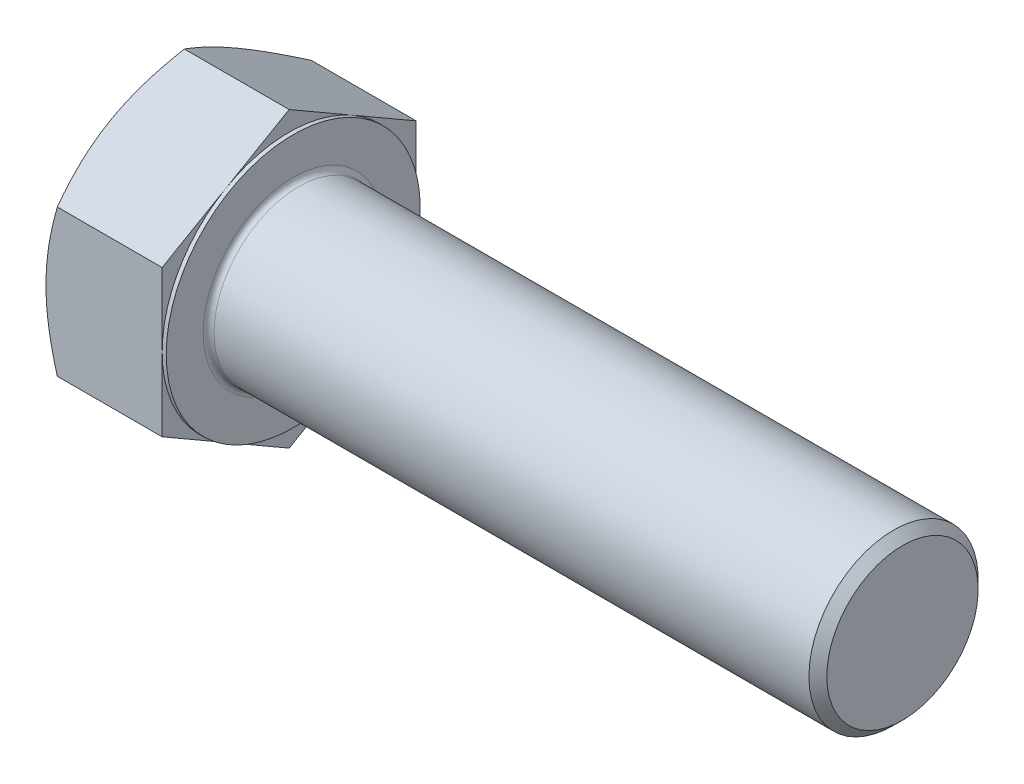
ISO-10303-21;
HEADER;
FILE_DESCRIPTION(('STEP AP214'),'2;1');
FILE_NAME('part.step','',(''),(''),'','','');
FILE_SCHEMA(('AUTOMOTIVE_DESIGN { 1 0 10303 214 1 1 1 1 }'));
ENDSEC;
DATA;
#1=APPLICATION_CONTEXT('core data for automotive mechanical design processes');
#2=APPLICATION_PROTOCOL_DEFINITION('international standard','automotive_design',2000,#1);
#3=PRODUCT_CONTEXT('',#1,'mechanical');
#4=PRODUCT('Part','Part','',(#3));
#5=PRODUCT_RELATED_PRODUCT_CATEGORY('part','',(#4));
#6=PRODUCT_DEFINITION_FORMATION('','',#4);
#7=PRODUCT_DEFINITION_CONTEXT('part definition',#1,'design');
#8=PRODUCT_DEFINITION('design','',#6,#7);
#9=PRODUCT_DEFINITION_SHAPE('','',#8);
#10=(LENGTH_UNIT() NAMED_UNIT(*) SI_UNIT(.MILLI.,.METRE.));
#11=(NAMED_UNIT(*) PLANE_ANGLE_UNIT() SI_UNIT($,.RADIAN.));
#12=(NAMED_UNIT(*) SI_UNIT($,.STERADIAN.) SOLID_ANGLE_UNIT());
#13=UNCERTAINTY_MEASURE_WITH_UNIT(LENGTH_MEASURE(1.E-05),#10,'distance_accuracy_value','');
#14=(GEOMETRIC_REPRESENTATION_CONTEXT(3) GLOBAL_UNCERTAINTY_ASSIGNED_CONTEXT((#13)) GLOBAL_UNIT_ASSIGNED_CONTEXT((#10,
#11,#12)) REPRESENTATION_CONTEXT('',''));
#15=CARTESIAN_POINT('',(0.,0.,0.));
#16=DIRECTION('',(0.,0.,1.));
#17=DIRECTION('',(1.,0.,0.));
#18=AXIS2_PLACEMENT_3D('',#15,#16,#17);
#19=CARTESIAN_POINT('',(11.2776,13.7554856334967,0.));
#20=DIRECTION('',(1.,0.,0.));
#21=DIRECTION('',(0.,0.,-1.));
#22=AXIS2_PLACEMENT_3D('',#19,#20,#21);
#23=PLANE('',#22);
#24=CARTESIAN_POINT('',(11.2776,0.,0.));
#25=DIRECTION('',(1.,0.,0.));
#26=DIRECTION('',(0.,0.,-1.));
#27=AXIS2_PLACEMENT_3D('',#24,#25,#26);
#28=CIRCLE('',#27,8.4455);
#29=CARTESIAN_POINT('',(11.2776,0.,-8.4455));
#30=VERTEX_POINT('',#29);
#31=EDGE_CURVE('E43',#30,#30,#28,.F.);
#32=ORIENTED_EDGE('',*,*,#31,.T.);
#33=EDGE_LOOP('',(#32));
#34=FACE_BOUND('',#33,.T.);
#35=CARTESIAN_POINT('',(11.2776,0.,0.));
#36=DIRECTION('',(1.,0.,0.));
#37=DIRECTION('',(0.,0.,-1.));
#38=AXIS2_PLACEMENT_3D('',#35,#36,#37);
#39=CIRCLE('',#38,11.9126);
#40=CARTESIAN_POINT('',(11.2776,0.,-11.9126));
#41=VERTEX_POINT('',#40);
#42=EDGE_CURVE('E256',#41,#41,#39,.T.);
#43=ORIENTED_EDGE('',*,*,#42,.T.);
#44=EDGE_LOOP('',(#43));
#45=FACE_BOUND('',#44,.T.);
#46=ADVANCED_FACE('F34',(#34,#45),#23,.T.);
#47=CARTESIAN_POINT('',(0.,0.,0.));
#48=DIRECTION('',(-1.,0.,0.));
#49=DIRECTION('',(0.,0.,1.));
#50=AXIS2_PLACEMENT_3D('',#47,#48,#49);
#51=CYLINDRICAL_SURFACE('',#50,7.9375);
#52=CARTESIAN_POINT('',(11.7856,0.,0.));
#53=DIRECTION('',(1.,0.,0.));
#54=DIRECTION('',(0.,0.,-1.));
#55=AXIS2_PLACEMENT_3D('',#52,#53,#54);
#56=CIRCLE('',#55,7.9375);
#57=CARTESIAN_POINT('',(11.7856,0.,-7.9375));
#58=VERTEX_POINT('',#57);
#59=EDGE_CURVE('E11',#58,#58,#56,.T.);
#60=ORIENTED_EDGE('',*,*,#59,.T.);
#61=EDGE_LOOP('',(#60));
#62=FACE_BOUND('',#61,.T.);
#63=CARTESIAN_POINT('',(67.58813,0.,0.));
#64=DIRECTION('',(-1.,0.,0.));
#65=DIRECTION('',(0.,0.,1.));
#66=AXIS2_PLACEMENT_3D('',#63,#64,#65);
#67=CIRCLE('',#66,7.9375);
#68=CARTESIAN_POINT('',(67.58813,0.,7.9375));
#69=VERTEX_POINT('',#68);
#70=EDGE_CURVE('E300',#69,#69,#67,.T.);
#71=ORIENTED_EDGE('',*,*,#70,.T.);
#72=EDGE_LOOP('',(#71));
#73=FACE_BOUND('',#72,.T.);
#74=ADVANCED_FACE('F243',(#62,#73),#51,.T.);
#75=CARTESIAN_POINT('',(68.4276,0.,0.));
#76=DIRECTION('',(-1.,0.,0.));
#77=DIRECTION('',(0.,0.,1.));
#78=AXIS2_PLACEMENT_3D('',#75,#76,#77);
#79=CONICAL_SURFACE('',#78,7.09803,0.785398163397435);
#80=ORIENTED_EDGE('',*,*,#70,.F.);
#81=EDGE_LOOP('',(#80));
#82=FACE_BOUND('',#81,.T.);
#83=CARTESIAN_POINT('',(68.4276,0.,0.));
#84=DIRECTION('',(-1.,0.,0.));
#85=DIRECTION('',(0.,0.,1.));
#86=AXIS2_PLACEMENT_3D('',#83,#84,#85);
#87=CIRCLE('',#86,7.09803);
#88=CARTESIAN_POINT('',(68.4276,0.,7.09803));
#89=VERTEX_POINT('',#88);
#90=EDGE_CURVE('E302',#89,#89,#87,.T.);
#91=ORIENTED_EDGE('',*,*,#90,.T.);
#92=EDGE_LOOP('',(#91));
#93=FACE_BOUND('',#92,.T.);
#94=ADVANCED_FACE('F248',(#82,#93),#79,.T.);
#95=CARTESIAN_POINT('',(68.4276,0.,0.));
#96=DIRECTION('',(-1.,0.,0.));
#97=DIRECTION('',(0.,0.,1.));
#98=AXIS2_PLACEMENT_3D('',#95,#96,#97);
#99=PLANE('',#98);
#100=ORIENTED_EDGE('',*,*,#90,.F.);
#101=EDGE_LOOP('',(#100));
#102=FACE_BOUND('',#101,.T.);
#103=ADVANCED_FACE('F349',(#102),#99,.F.);
#104=CARTESIAN_POINT('',(10.8966,11.9126,0.));
#105=DIRECTION('',(1.,0.,0.));
#106=DIRECTION('',(0.,0.,-1.));
#107=AXIS2_PLACEMENT_3D('',#104,#105,#106);
#108=PLANE('',#107);
#109=DIRECTION('',(0.,0.500000000000001,0.866025403784438));
#110=VECTOR('',#109,1.);
#111=CARTESIAN_POINT('',(10.8966,6.87774281674832,-11.9126));
#112=LINE('',#111,#110);
#113=CARTESIAN_POINT('',(10.8966,6.87774281674832,-11.9126));
#114=VERTEX_POINT('',#113);
#115=CARTESIAN_POINT('',(10.8966,10.3166142251225,-5.95630000000001));
#116=VERTEX_POINT('',#115);
#117=EDGE_CURVE('E167',#114,#116,#112,.T.);
#118=ORIENTED_EDGE('',*,*,#117,.T.);
#119=CARTESIAN_POINT('',(10.8966,0.,0.));
#120=DIRECTION('',(-1.,0.,0.));
#121=DIRECTION('',(0.,0.,1.));
#122=AXIS2_PLACEMENT_3D('',#119,#120,#121);
#123=CIRCLE('',#122,11.9126);
#124=CARTESIAN_POINT('',(10.8966,0.,-11.9126));
#125=VERTEX_POINT('',#124);
#126=EDGE_CURVE('E50',#116,#125,#123,.T.);
#127=ORIENTED_EDGE('',*,*,#126,.T.);
#128=DIRECTION('',(0.,1.,0.));
#129=VECTOR('',#128,1.);
#130=CARTESIAN_POINT('',(10.8966,6.87774281674832,-11.9126));
#131=LINE('',#130,#129);
#132=EDGE_CURVE('E257',#125,#114,#131,.T.);
#133=ORIENTED_EDGE('',*,*,#132,.T.);
#134=EDGE_LOOP('',(#118,#127,#133));
#135=FACE_BOUND('',#134,.T.);
#136=ADVANCED_FACE('F279',(#135),#108,.T.);
#137=CARTESIAN_POINT('',(10.8966,13.7554856334967,0.));
#138=VERTEX_POINT('',#137);
#139=EDGE_CURVE('E165',#116,#138,#112,.T.);
#140=ORIENTED_EDGE('',*,*,#139,.T.);
#141=DIRECTION('',(0.,-0.500000000000001,0.866025403784438));
#142=VECTOR('',#141,1.);
#143=CARTESIAN_POINT('',(10.8966,13.7554856334967,0.));
#144=LINE('',#143,#142);
#145=CARTESIAN_POINT('',(10.8966,10.3166142251225,5.95630000000001));
#146=VERTEX_POINT('',#145);
#147=EDGE_CURVE('E164',#138,#146,#144,.T.);
#148=ORIENTED_EDGE('',*,*,#147,.T.);
#149=EDGE_CURVE('E153',#146,#116,#123,.T.);
#150=ORIENTED_EDGE('',*,*,#149,.T.);
#151=EDGE_LOOP('',(#140,#148,#150));
#152=FACE_BOUND('',#151,.T.);
#153=ADVANCED_FACE('F286',(#152),#108,.T.);
#154=CARTESIAN_POINT('',(10.8966,6.87774281674832,11.9126));
#155=VERTEX_POINT('',#154);
#156=EDGE_CURVE('E132',#146,#155,#144,.T.);
#157=ORIENTED_EDGE('',*,*,#156,.T.);
#158=DIRECTION('',(0.,-1.,0.));
#159=VECTOR('',#158,1.);
#160=CARTESIAN_POINT('',(10.8966,6.87774281674832,11.9126));
#161=LINE('',#160,#159);
#162=CARTESIAN_POINT('',(10.8966,0.,11.9126));
#163=VERTEX_POINT('',#162);
#164=EDGE_CURVE('E126',#155,#163,#161,.T.);
#165=ORIENTED_EDGE('',*,*,#164,.T.);
#166=EDGE_CURVE('E130',#163,#146,#123,.T.);
#167=ORIENTED_EDGE('',*,*,#166,.T.);
#168=EDGE_LOOP('',(#157,#165,#167));
#169=FACE_BOUND('',#168,.T.);
#170=ADVANCED_FACE('F128',(#169),#108,.T.);
#171=CARTESIAN_POINT('',(10.8966,-6.87774281674834,11.9126));
#172=VERTEX_POINT('',#171);
#173=EDGE_CURVE('E136',#163,#172,#161,.T.);
#174=ORIENTED_EDGE('',*,*,#173,.T.);
#175=DIRECTION('',(0.,-0.500000000000001,-0.866025403784438));
#176=VECTOR('',#175,1.);
#177=CARTESIAN_POINT('',(10.8966,-13.7554856334967,0.));
#178=LINE('',#177,#176);
#179=CARTESIAN_POINT('',(10.8966,-10.3166142251225,5.95630000000001));
#180=VERTEX_POINT('',#179);
#181=EDGE_CURVE('E143',#172,#180,#178,.T.);
#182=ORIENTED_EDGE('',*,*,#181,.T.);
#183=EDGE_CURVE('E140',#180,#163,#123,.T.);
#184=ORIENTED_EDGE('',*,*,#183,.T.);
#185=EDGE_LOOP('',(#174,#182,#184));
#186=FACE_BOUND('',#185,.T.);
#187=ADVANCED_FACE('F141',(#186),#108,.T.);
#188=CARTESIAN_POINT('',(10.8966,-13.7554856334967,0.));
#189=VERTEX_POINT('',#188);
#190=EDGE_CURVE('E159',#180,#189,#178,.T.);
#191=ORIENTED_EDGE('',*,*,#190,.T.);
#192=DIRECTION('',(0.,0.5,-0.866025403784439));
#193=VECTOR('',#192,1.);
#194=CARTESIAN_POINT('',(10.8966,-6.87774281674835,-11.9126));
#195=LINE('',#194,#193);
#196=CARTESIAN_POINT('',(10.8966,-10.3166142251225,-5.9563));
#197=VERTEX_POINT('',#196);
#198=EDGE_CURVE('E340',#189,#197,#195,.T.);
#199=ORIENTED_EDGE('',*,*,#198,.T.);
#200=EDGE_CURVE('E147',#197,#180,#123,.T.);
#201=ORIENTED_EDGE('',*,*,#200,.T.);
#202=EDGE_LOOP('',(#191,#199,#201));
#203=FACE_BOUND('',#202,.T.);
#204=ADVANCED_FACE('F341',(#203),#108,.T.);
#205=CARTESIAN_POINT('',(10.8966,-6.87774281674835,-11.9126));
#206=VERTEX_POINT('',#205);
#207=EDGE_CURVE('E154',#197,#206,#195,.T.);
#208=ORIENTED_EDGE('',*,*,#207,.T.);
#209=EDGE_CURVE('E260',#206,#125,#131,.T.);
#210=ORIENTED_EDGE('',*,*,#209,.T.);
#211=EDGE_CURVE('E272',#125,#197,#123,.T.);
#212=ORIENTED_EDGE('',*,*,#211,.T.);
#213=EDGE_LOOP('',(#208,#210,#212));
#214=FACE_BOUND('',#213,.T.);
#215=ADVANCED_FACE('F271',(#214),#108,.T.);
#216=CARTESIAN_POINT('',(0.,0.,0.));
#217=DIRECTION('',(-1.,0.,0.));
#218=DIRECTION('',(0.,0.,1.));
#219=AXIS2_PLACEMENT_3D('',#216,#217,#218);
#220=CYLINDRICAL_SURFACE('',#219,11.9126);
#221=ORIENTED_EDGE('',*,*,#126,.F.);
#222=ORIENTED_EDGE('',*,*,#149,.F.);
#223=ORIENTED_EDGE('',*,*,#166,.F.);
#224=ORIENTED_EDGE('',*,*,#183,.F.);
#225=ORIENTED_EDGE('',*,*,#200,.F.);
#226=ORIENTED_EDGE('',*,*,#211,.F.);
#227=EDGE_LOOP('',(#221,#222,#223,#224,#225,#226));
#228=FACE_BOUND('',#227,.T.);
#229=ORIENTED_EDGE('',*,*,#42,.F.);
#230=EDGE_LOOP('',(#229));
#231=FACE_BOUND('',#230,.T.);
#232=ADVANCED_FACE('F150',(#228,#231),#220,.T.);
#233=CARTESIAN_POINT('',(0.,13.7554856334967,0.));
#234=DIRECTION('',(1.,0.,0.));
#235=DIRECTION('',(0.,0.,-1.));
#236=AXIS2_PLACEMENT_3D('',#233,#234,#235);
#237=PLANE('',#236);
#238=CARTESIAN_POINT('',(0.,0.,0.));
#239=DIRECTION('',(1.,0.,0.));
#240=DIRECTION('',(0.,0.,-1.));
#241=AXIS2_PLACEMENT_3D('',#238,#239,#240);
#242=CIRCLE('',#241,11.9126);
#243=CARTESIAN_POINT('',(0.,0.,-11.9126));
#244=VERTEX_POINT('',#243);
#245=CARTESIAN_POINT('',(0.,10.3166142251225,-5.95630000000001));
#246=VERTEX_POINT('',#245);
#247=EDGE_CURVE('E258',#244,#246,#242,.T.);
#248=ORIENTED_EDGE('',*,*,#247,.F.);
#249=CARTESIAN_POINT('',(0.,-10.3166142251225,-5.9563));
#250=VERTEX_POINT('',#249);
#251=EDGE_CURVE('E264',#250,#244,#242,.T.);
#252=ORIENTED_EDGE('',*,*,#251,.F.);
#253=CARTESIAN_POINT('',(0.,-10.3166142251225,5.95630000000001));
#254=VERTEX_POINT('',#253);
#255=EDGE_CURVE('E322',#254,#250,#242,.T.);
#256=ORIENTED_EDGE('',*,*,#255,.F.);
#257=CARTESIAN_POINT('',(0.,0.,11.9126));
#258=VERTEX_POINT('',#257);
#259=EDGE_CURVE('E318',#258,#254,#242,.T.);
#260=ORIENTED_EDGE('',*,*,#259,.F.);
#261=CARTESIAN_POINT('',(0.,0.,0.));
#262=DIRECTION('',(-1.,0.,0.));
#263=DIRECTION('',(0.,0.,1.));
#264=AXIS2_PLACEMENT_3D('',#261,#262,#263);
#265=CIRCLE('',#264,11.9126);
#266=CARTESIAN_POINT('',(0.,10.3166142251225,5.95630000000001));
#267=VERTEX_POINT('',#266);
#268=EDGE_CURVE('E168',#258,#267,#265,.T.);
#269=ORIENTED_EDGE('',*,*,#268,.T.);
#270=EDGE_CURVE('E262',#246,#267,#242,.T.);
#271=ORIENTED_EDGE('',*,*,#270,.F.);
#272=EDGE_LOOP('',(#248,#252,#256,#260,#269,#271));
#273=FACE_BOUND('',#272,.T.);
#274=ADVANCED_FACE('F319',(#273),#237,.F.);
#275=CARTESIAN_POINT('',(0.,0.,0.));
#276=DIRECTION('',(1.,0.,0.));
#277=DIRECTION('',(0.,0.,-1.));
#278=AXIS2_PLACEMENT_3D('',#275,#276,#277);
#279=CONICAL_SURFACE('',#278,11.9126,1.0471975511966);
#280=CARTESIAN_POINT('',(1.06405718409108,6.87762734669449,11.9128));
#281=CARTESIAN_POINT('',(0.976783664508617,7.02881492530846,11.6509354323673));
#282=CARTESIAN_POINT('',(0.893471253108558,7.18056620885786,11.3880944991459));
#283=CARTESIAN_POINT('',(0.735867732768955,7.48528570607427,10.8603048479103));
#284=CARTESIAN_POINT('',(0.661579590915739,7.63825430246197,10.5953554670043));
#285=CARTESIAN_POINT('',(0.453689244257348,8.09962486135311,9.79623821788836));
#286=CARTESIAN_POINT('',(0.335442444727208,8.40984814214741,9.25891573386193));
#287=CARTESIAN_POINT('',(0.196787480113801,8.87408305648911,8.45483727557474));
#288=CARTESIAN_POINT('',(0.157289977847039,9.02670778330657,8.19048349423558));
#289=CARTESIAN_POINT('',(0.0910554529301021,9.33266389998358,7.66055195526452));
#290=CARTESIAN_POINT('',(0.0643186758890399,9.48599530338738,7.3949741741733));
#291=CARTESIAN_POINT('',(0.0242904493695607,9.79291374255692,6.86337584375192));
#292=CARTESIAN_POINT('',(0.0109830224718128,9.94650025627591,6.59735619863326));
#293=CARTESIAN_POINT('',(-0.00190293681881722,10.2538155954142,6.06507041730042));
#294=CARTESIAN_POINT('',(-0.00148189340275153,10.4075444162897,5.79880428895645));
#295=CARTESIAN_POINT('',(0.0121309718551364,10.6949407144099,5.30101929870509));
#296=CARTESIAN_POINT('',(0.0236623230980982,10.8286286877692,5.06946493648576));
#297=CARTESIAN_POINT('',(0.0568905531657718,11.0956971533324,4.60688878503089));
#298=CARTESIAN_POINT('',(0.0785881510523466,11.2290776231157,4.37586703462887));
#299=CARTESIAN_POINT('',(0.131770595047064,11.4954585954488,3.91448165637838));
#300=CARTESIAN_POINT('',(0.163263524933217,11.6284586922618,3.68411873128659));
#301=CARTESIAN_POINT('',(0.235484072021093,11.8938353504966,3.22447287608111));
#302=CARTESIAN_POINT('',(0.276212316904162,12.0262118689121,2.9951900204564));
#303=CARTESIAN_POINT('',(0.413279595473438,12.4280482226135,2.29918903951742));
#304=CARTESIAN_POINT('',(0.523285805769445,12.6963443903513,1.83448644551948));
#305=CARTESIAN_POINT('',(0.772955074257754,13.2289360452756,0.912010639503379));
#306=CARTESIAN_POINT('',(0.912559494718526,13.4932383517035,0.45422561621254));
#307=CARTESIAN_POINT('',(1.06405718409109,13.7556011035505,-0.000199999999998149));
#308=B_SPLINE_CURVE_WITH_KNOTS('',3,(#280,#281,#282,#283,#284,#285,#286,#287,#288,#289,#290,
#291,#292,#293,#294,#295,#296,#297,#298,#299,#300,#301,#302,#303,#304,#305,#306,#307),
.UNSPECIFIED.,.F.,.F.,(4,2,2,2,2,2,2,2,2,2,2,2,2,4),(0.,0.944078444311424,1.88846645648341,
3.78126264443506,4.70443047983598,5.62761608298022,6.54970203686552,7.47175949957655,
8.27443960121627,9.0771764852477,9.8805776083397,10.6840333512391,12.3262779583689,
13.9652989788094),.UNSPECIFIED.);
#309=CARTESIAN_POINT('',(1.06399051658499,13.7554856334967,0.));
#310=VERTEX_POINT('',#309);
#311=EDGE_CURVE('E214',#267,#310,#308,.T.);
#312=ORIENTED_EDGE('',*,*,#311,.T.);
#313=CARTESIAN_POINT('',(1.06405718409109,13.7556011035505,0.0002));
#314=CARTESIAN_POINT('',(0.976783664508627,13.6044135249365,-0.261664567632711));
#315=CARTESIAN_POINT('',(0.893471253108567,13.4526622413871,-0.52450550085407));
#316=CARTESIAN_POINT('',(0.735867732768963,13.1479427441707,-1.05229515208973));
#317=CARTESIAN_POINT('',(0.661579590915747,12.994974147783,-1.31724453299573));
#318=CARTESIAN_POINT('',(0.453689244257354,12.5336035888919,-2.11636178211163));
#319=CARTESIAN_POINT('',(0.335442444727213,12.2233803080976,-2.65368426613807));
#320=CARTESIAN_POINT('',(0.196787480113805,11.7591453937559,-3.45776272442526));
#321=CARTESIAN_POINT('',(0.157289977847043,11.6065206669384,-3.72211650576442));
#322=CARTESIAN_POINT('',(0.0910554529301061,11.3005645502614,-4.25204804473548));
#323=CARTESIAN_POINT('',(0.0643186758890441,11.1472331468576,-4.5176258258267));
#324=CARTESIAN_POINT('',(0.0242904493695635,10.8403147076881,-5.04922415624808));
#325=CARTESIAN_POINT('',(0.0109830224718141,10.6867281939691,-5.31524380136674));
#326=CARTESIAN_POINT('',(-0.001902936818817,10.3794128548308,-5.84752958269958));
#327=CARTESIAN_POINT('',(-0.00148189340275083,10.2256840339553,-6.11379571104355));
#328=CARTESIAN_POINT('',(0.0121309718551367,9.93828773583512,-6.61158070129491));
#329=CARTESIAN_POINT('',(0.0236623230980977,9.80459976247575,-6.84313506351425));
#330=CARTESIAN_POINT('',(0.0568905531657709,9.53753129691258,-7.30571121496911));
#331=CARTESIAN_POINT('',(0.078588151052346,9.40415082712931,-7.53673296537114));
#332=CARTESIAN_POINT('',(0.131770595047063,9.13776985479624,-7.99811834362163));
#333=CARTESIAN_POINT('',(0.163263524933215,9.00476975798318,-8.22848126871341));
#334=CARTESIAN_POINT('',(0.235484072021091,8.7393930997484,-8.6881271239189));
#335=CARTESIAN_POINT('',(0.276212316904159,8.60701658133291,-8.9174099795436));
#336=CARTESIAN_POINT('',(0.413279595473435,8.20518022763155,-9.61341096048258));
#337=CARTESIAN_POINT('',(0.523285805769441,7.93688405989371,-10.0781135544805));
#338=CARTESIAN_POINT('',(0.772955074257748,7.4042924049694,-11.0005893604966));
#339=CARTESIAN_POINT('',(0.91255949471852,7.13999009854146,-11.4583743837875));
#340=CARTESIAN_POINT('',(1.06405718409109,6.87762734669449,-11.9128));
#341=B_SPLINE_CURVE_WITH_KNOTS('',3,(#313,#314,#315,#316,#317,#318,#319,#320,#321,#322,#323,
#324,#325,#326,#327,#328,#329,#330,#331,#332,#333,#334,#335,#336,#337,#338,#339,#340),
.UNSPECIFIED.,.F.,.F.,(4,2,2,2,2,2,2,2,2,2,2,2,2,4),(0.,0.944078444311426,1.88846645648341,
3.78126264443507,4.70443047983598,5.62761608298023,6.54970203686553,7.47175949957655,
8.27443960121628,9.07717648524771,9.88057760833972,10.6840333512391,12.3262779583689,
13.9652989788094),.UNSPECIFIED.);
#342=EDGE_CURVE('E58',#310,#246,#341,.T.);
#343=ORIENTED_EDGE('',*,*,#342,.T.);
#344=ORIENTED_EDGE('',*,*,#270,.T.);
#345=EDGE_LOOP('',(#312,#343,#344));
#346=FACE_BOUND('',#345,.T.);
#347=ADVANCED_FACE('F316',(#346),#279,.T.);
#348=CARTESIAN_POINT('',(5.94970925875633,-18.7542139661494,11.9126));
#349=CARTESIAN_POINT('',(5.82234818048789,-18.4928727974389,11.9126));
#350=CARTESIAN_POINT('',(5.69560135070767,-18.2312324217909,11.9126));
#351=CARTESIAN_POINT('',(5.44347476985747,-17.7072909165591,11.9126));
#352=CARTESIAN_POINT('',(5.31809503170947,-17.4449897807586,11.9126));
#353=CARTESIAN_POINT('',(4.94418304852805,-16.6569356294817,11.9126));
#354=CARTESIAN_POINT('',(4.69791375457632,-16.1301049719507,11.9126));
#355=CARTESIAN_POINT('',(4.21157984802318,-15.0702748239756,11.9126));
#356=CARTESIAN_POINT('',(3.97155397445634,-14.5372575158563,11.9126));
#357=CARTESIAN_POINT('',(3.50095392487091,-13.4670809562063,11.9126));
#358=CARTESIAN_POINT('',(3.27037932037955,-12.9299218937564,11.9126));
#359=CARTESIAN_POINT('',(2.81351249142422,-11.8322005548373,11.9126));
#360=CARTESIAN_POINT('',(2.58763459406346,-11.2714649640731,11.9126));
#361=CARTESIAN_POINT('',(2.15230553566041,-10.143533692625,11.9126));
#362=CARTESIAN_POINT('',(1.94285617869939,-9.57633731026729,11.9126));
#363=CARTESIAN_POINT('',(1.54568241288974,-8.43557430298785,11.9126));
#364=CARTESIAN_POINT('',(1.3579163263929,-7.86202230215092,11.9126));
#365=CARTESIAN_POINT('',(1.00993657684322,-6.70664207817495,11.9126));
#366=CARTESIAN_POINT('',(0.849714525239861,-6.12481643343325,11.9126));
#367=CARTESIAN_POINT('',(0.636140538585311,-5.24738011922406,11.9126));
#368=CARTESIAN_POINT('',(0.569563372018273,-4.95497087470539,11.9126));
#369=CARTESIAN_POINT('',(0.446092765334137,-4.36810440137935,11.9126));
#370=CARTESIAN_POINT('',(0.389199140334896,-4.07364721178393,11.9126));
#371=CARTESIAN_POINT('',(0.286081809949052,-3.4828677048722,11.9126));
#372=CARTESIAN_POINT('',(0.239857868680085,-3.18654542893751,11.9126));
#373=CARTESIAN_POINT('',(0.158990484477783,-2.5923261546057,11.9126));
#374=CARTESIAN_POINT('',(0.12434656974194,-2.29442922086699,11.9126));
#375=CARTESIAN_POINT('',(0.0677779427020743,-1.70148713605668,11.9126));
#376=CARTESIAN_POINT('',(0.0456875892940456,-1.40645788602697,11.9126));
#377=CARTESIAN_POINT('',(0.0140149224537302,-0.815729195615569,11.9126));
#378=CARTESIAN_POINT('',(0.00443239360530382,-0.520029766863897,11.9126));
#379=CARTESIAN_POINT('',(-0.00199515402287978,0.0715096390407325,11.9126));
#380=CARTESIAN_POINT('',(0.00115979601589137,0.367349615847855,11.9126));
#381=CARTESIAN_POINT('',(0.0201269052143894,0.958626572902714,11.9126));
#382=CARTESIAN_POINT('',(0.0359396319140156,1.25406353448537,11.9126));
#383=CARTESIAN_POINT('',(0.0881900626712276,1.95579537069577,11.9126));
#384=CARTESIAN_POINT('',(0.130171870721694,2.36168693214837,11.9126));
#385=CARTESIAN_POINT('',(0.235798614857138,3.17061943899898,11.9126));
#386=CARTESIAN_POINT('',(0.299446267258226,3.57366002048975,11.9126));
#387=CARTESIAN_POINT('',(0.519526712459977,4.77795496083166,11.9126));
#388=CARTESIAN_POINT('',(0.705062098438547,5.57397045770545,11.9126));
#389=CARTESIAN_POINT('',(1.02886250414959,6.76459274189145,11.9126));
#390=CARTESIAN_POINT('',(1.14593945289588,7.16531890264451,11.9126));
#391=CARTESIAN_POINT('',(1.3927734098554,7.96288518331469,11.9126));
#392=CARTESIAN_POINT('',(1.52253050784117,8.35972527569746,11.9126));
#393=CARTESIAN_POINT('',(1.79260014284329,9.14963410456566,11.9126));
#394=CARTESIAN_POINT('',(1.9329095872754,9.54270390822858,11.9126));
#395=CARTESIAN_POINT('',(2.22238149261939,10.3255524923865,11.9126));
#396=CARTESIAN_POINT('',(2.37154381108587,10.7153313257189,11.9126));
#397=CARTESIAN_POINT('',(2.75376228365969,11.6863021306056,11.9126));
#398=CARTESIAN_POINT('',(2.99144639042499,12.2656697048356,11.9126));
#399=CARTESIAN_POINT('',(3.47963627087923,13.4189957570025,11.9126));
#400=CARTESIAN_POINT('',(3.73014309198333,13.9929537885155,11.9126));
#401=CARTESIAN_POINT('',(4.24122572334288,15.136558010749,11.9126));
#402=CARTESIAN_POINT('',(4.501804471228,15.7062028846464,11.9126));
#403=CARTESIAN_POINT('',(5.03084646272709,16.8417887479888,11.9126));
#404=CARTESIAN_POINT('',(5.29930947776626,17.4077298442304,11.9126));
#405=CARTESIAN_POINT('',(5.84290854153855,18.5373224794203,11.9126));
#406=CARTESIAN_POINT('',(6.11805301715263,19.1009699551898,11.9126));
#407=CARTESIAN_POINT('',(6.67346343992968,20.2257360466019,11.9126));
#408=CARTESIAN_POINT('',(6.95372941703405,20.7868546474362,11.9126));
#409=CARTESIAN_POINT('',(7.51840343247423,21.9068823714061,11.9126));
#410=CARTESIAN_POINT('',(7.80281076216087,22.4657918522205,11.9126));
#411=CARTESIAN_POINT('',(8.37509552911098,23.581832422269,11.9126));
#412=CARTESIAN_POINT('',(8.66297298078972,24.1389635041032,11.9126));
#413=CARTESIAN_POINT('',(9.47712702091915,25.7046353801467,11.9126));
#414=CARTESIAN_POINT('',(10.0067075333492,26.7114579429173,11.9126));
#415=CARTESIAN_POINT('',(11.0728754827518,28.7214372402771,11.9126));
#416=CARTESIAN_POINT('',(11.6094632446457,29.7245938020962,11.9126));
#417=CARTESIAN_POINT('',(12.6863573923736,31.7251057329577,11.9126));
#418=CARTESIAN_POINT('',(13.2266482129029,32.7224694867,11.9126));
#419=CARTESIAN_POINT('',(14.0401345009696,34.2168103612077,11.9126));
#420=CARTESIAN_POINT('',(14.3117960675622,34.7146237201592,11.9126));
#421=CARTESIAN_POINT('',(14.8560321079032,35.7097502563854,11.9126));
#422=CARTESIAN_POINT('',(15.1286065803027,36.2070634343978,11.9126));
#423=CARTESIAN_POINT('',(15.4015831488561,36.7041558639482,11.9126));
#424=B_SPLINE_CURVE_WITH_KNOTS('',3,(#348,#349,#350,#351,#352,#353,#354,#355,#356,#357,#358,
#359,#360,#361,#362,#363,#364,#365,#366,#367,#368,#369,#370,#371,#372,#373,#374,#375,#376,#377,
#378,#379,#380,#381,#382,#383,#384,#385,#386,#387,#388,#389,#390,#391,#392,#393,#394,#395,#396,
#397,#398,#399,#400,#401,#402,#403,#404,#405,#406,#407,#408,#409,#410,#411,#412,#413,#414,#415,
#416,#417,#418,#419,#420,#421,#422,#423),.UNSPECIFIED.,.F.,.F.,(4,2,2,2,2,2,2,2,2,2,2,2,2,2,2,2,
2,2,2,2,2,2,2,2,2,2,2,2,2,2,2,2,2,2,2,2,2,4),(0.,0.872168478030113,1.74434519280531,
3.4889426954726,5.24257537789789,6.99612847135617,8.80949380535288,10.6230579939955,
12.4330761532365,14.242542090152,15.1420860899301,16.0416129133186,16.9411198483164,
17.84059013043,18.7278988061825,19.6151922000503,20.5024834218167,21.3898144295102,
22.6132994610988,23.8369379414441,26.2854498806988,27.537773871374,28.7901067288568,
30.0420739837835,31.2940210996391,33.1724857105539,35.0511040082666,36.930274430352,
38.8093904266059,40.6910140465858,42.5726486704692,44.4539650155795,46.3352891785801,
49.7480645223263,53.1609986799736,56.5639015420495,58.2652424673573,59.9665808800727),.UNSPECIFIED.);
#425=CARTESIAN_POINT('',(1.06399051658498,6.87774281674832,11.9126));
#426=VERTEX_POINT('',#425);
#427=EDGE_CURVE('E226',#258,#426,#424,.T.);
#428=ORIENTED_EDGE('',*,*,#427,.T.);
#429=EDGE_CURVE('E225',#426,#267,#308,.T.);
#430=ORIENTED_EDGE('',*,*,#429,.T.);
#431=ORIENTED_EDGE('',*,*,#268,.F.);
#432=EDGE_LOOP('',(#428,#430,#431));
#433=FACE_BOUND('',#432,.T.);
#434=ADVANCED_FACE('F313',(#433),#279,.T.);
#435=CARTESIAN_POINT('',(1.06399051658498,-6.87774281674834,11.9126));
#436=VERTEX_POINT('',#435);
#437=EDGE_CURVE('E304',#436,#258,#424,.T.);
#438=ORIENTED_EDGE('',*,*,#437,.T.);
#439=ORIENTED_EDGE('',*,*,#259,.T.);
#440=CARTESIAN_POINT('',(1.0640571840911,-13.7556011035505,-0.000200000000000211));
#441=CARTESIAN_POINT('',(0.976783664508636,-13.6044135249366,0.261664567632711));
#442=CARTESIAN_POINT('',(0.893471253108576,-13.4526622413872,0.52450550085407));
#443=CARTESIAN_POINT('',(0.735867732768973,-13.1479427441708,1.05229515208973));
#444=CARTESIAN_POINT('',(0.661579590915756,-12.994974147783,1.31724453299573));
#445=CARTESIAN_POINT('',(0.453689244257363,-12.5336035888919,2.11636178211164));
#446=CARTESIAN_POINT('',(0.335442444727221,-12.2233803080976,2.65368426613807));
#447=CARTESIAN_POINT('',(0.196787480113814,-11.7591453937559,3.45776272442527));
#448=CARTESIAN_POINT('',(0.157289977847052,-11.6065206669384,3.72211650576443));
#449=CARTESIAN_POINT('',(0.0910554529301147,-11.3005645502614,4.25204804473548));
#450=CARTESIAN_POINT('',(0.0643186758890521,-11.1472331468576,4.5176258258267));
#451=CARTESIAN_POINT('',(0.0242904493695715,-10.8403147076881,5.04922415624809));
#452=CARTESIAN_POINT('',(0.0109830224718226,-10.6867281939691,5.31524380136674));
#453=CARTESIAN_POINT('',(-0.00190293681880851,-10.3794128548308,5.84752958269958));
#454=CARTESIAN_POINT('',(-0.00148189340274294,-10.2256840339553,6.11379571104356));
#455=CARTESIAN_POINT('',(0.0121309718551452,-9.93828773583513,6.61158070129492));
#456=CARTESIAN_POINT('',(0.0236623230981074,-9.80459976247577,6.84313506351425));
#457=CARTESIAN_POINT('',(0.0568905531657807,-9.5375312969126,7.30571121496912));
#458=CARTESIAN_POINT('',(0.078588151052355,-9.40415082712933,7.53673296537114));
#459=CARTESIAN_POINT('',(0.131770595047071,-9.13776985479625,7.99811834362163));
#460=CARTESIAN_POINT('',(0.163263524933222,-9.0047697579832,8.22848126871342));
#461=CARTESIAN_POINT('',(0.235484072021098,-8.73939309974842,8.6881271239189));
#462=CARTESIAN_POINT('',(0.276212316904167,-8.60701658133293,8.9174099795436));
#463=CARTESIAN_POINT('',(0.413279595473442,-8.20518022763156,9.61341096048258));
#464=CARTESIAN_POINT('',(0.523285805769447,-7.93688405989373,10.0781135544805));
#465=CARTESIAN_POINT('',(0.772955074257754,-7.40429240496942,11.0005893604966));
#466=CARTESIAN_POINT('',(0.912559494718525,-7.13999009854147,11.4583743837875));
#467=CARTESIAN_POINT('',(1.06405718409109,-6.8776273466945,11.9128));
#468=B_SPLINE_CURVE_WITH_KNOTS('',3,(#440,#441,#442,#443,#444,#445,#446,#447,#448,#449,#450,
#451,#452,#453,#454,#455,#456,#457,#458,#459,#460,#461,#462,#463,#464,#465,#466,#467),
.UNSPECIFIED.,.F.,.F.,(4,2,2,2,2,2,2,2,2,2,2,2,2,4),(0.,0.944078444311425,1.88846645648341,
3.78126264443507,4.70443047983599,5.62761608298023,6.54970203686554,7.47175949957656,
8.27443960121629,9.07717648524771,9.88057760833972,10.6840333512391,12.3262779583689,
13.9652989788094),.UNSPECIFIED.);
#469=EDGE_CURVE('E216',#254,#436,#468,.T.);
#470=ORIENTED_EDGE('',*,*,#469,.T.);
#471=EDGE_LOOP('',(#438,#439,#470));
#472=FACE_BOUND('',#471,.T.);
#473=ADVANCED_FACE('F186',(#472),#279,.T.);
#474=CARTESIAN_POINT('',(1.063990516585,-13.7554856334967,0.));
#475=VERTEX_POINT('',#474);
#476=EDGE_CURVE('E209',#475,#254,#468,.T.);
#477=ORIENTED_EDGE('',*,*,#476,.T.);
#478=ORIENTED_EDGE('',*,*,#255,.T.);
#479=CARTESIAN_POINT('',(1.0640571840911,-6.87762734669452,-11.9128));
#480=CARTESIAN_POINT('',(0.976783664508629,-7.02881492530849,-11.6509354323673));
#481=CARTESIAN_POINT('',(0.89347125310857,-7.18056620885789,-11.3880944991459));
#482=CARTESIAN_POINT('',(0.735867732768967,-7.4852857060743,-10.8603048479103));
#483=CARTESIAN_POINT('',(0.661579590915751,-7.638254302462,-10.5953554670043));
#484=CARTESIAN_POINT('',(0.453689244257359,-8.09962486135314,-9.79623821788837));
#485=CARTESIAN_POINT('',(0.335442444727219,-8.40984814214745,-9.25891573386193));
#486=CARTESIAN_POINT('',(0.196787480113813,-8.87408305648914,-8.45483727557473));
#487=CARTESIAN_POINT('',(0.157289977847052,-9.0267077833066,-8.19048349423557));
#488=CARTESIAN_POINT('',(0.0910554529301148,-9.33266389998361,-7.66055195526452));
#489=CARTESIAN_POINT('',(0.0643186758890524,-9.48599530338741,-7.3949741741733));
#490=CARTESIAN_POINT('',(0.0242904493695732,-9.79291374255695,-6.86337584375191));
#491=CARTESIAN_POINT('',(0.0109830224718253,-9.94650025627594,-6.59735619863326));
#492=CARTESIAN_POINT('',(-0.0019029368188042,-10.2538155954143,-6.06507041730042));
#493=CARTESIAN_POINT('',(-0.00148189340273813,-10.4075444162897,-5.79880428895644));
#494=CARTESIAN_POINT('',(0.01213097185515,-10.6949407144099,-5.30101929870508));
#495=CARTESIAN_POINT('',(0.0236623230981117,-10.8286286877693,-5.06946493648575));
#496=CARTESIAN_POINT('',(0.0568905531657858,-11.0956971533324,-4.60688878503088));
#497=CARTESIAN_POINT('',(0.0785881510523611,-11.2290776231157,-4.37586703462886));
#498=CARTESIAN_POINT('',(0.131770595047078,-11.4954585954488,-3.91448165637837));
#499=CARTESIAN_POINT('',(0.16326352493323,-11.6284586922618,-3.68411873128658));
#500=CARTESIAN_POINT('',(0.235484072021105,-11.8938353504966,-3.2244728760811));
#501=CARTESIAN_POINT('',(0.276212316904175,-12.0262118689121,-2.9951900204564));
#502=CARTESIAN_POINT('',(0.413279595473452,-12.4280482226135,-2.29918903951742));
#503=CARTESIAN_POINT('',(0.523285805769458,-12.6963443903513,-1.83448644551947));
#504=CARTESIAN_POINT('',(0.772955074257765,-13.2289360452756,-0.912010639503377));
#505=CARTESIAN_POINT('',(0.912559494718536,-13.4932383517036,-0.454225616212538));
#506=CARTESIAN_POINT('',(1.0640571840911,-13.7556011035505,0.000199999999997922));
#507=B_SPLINE_CURVE_WITH_KNOTS('',3,(#479,#480,#481,#482,#483,#484,#485,#486,#487,#488,#489,
#490,#491,#492,#493,#494,#495,#496,#497,#498,#499,#500,#501,#502,#503,#504,#505,#506),
.UNSPECIFIED.,.F.,.F.,(4,2,2,2,2,2,2,2,2,2,2,2,2,4),(0.,0.944078444311426,1.88846645648341,
3.78126264443507,4.70443047983599,5.62761608298023,6.54970203686553,7.47175949957656,
8.27443960121629,9.07717648524771,9.88057760833972,10.6840333512391,12.3262779583689,
13.9652989788094),.UNSPECIFIED.);
#508=EDGE_CURVE('E215',#250,#475,#507,.T.);
#509=ORIENTED_EDGE('',*,*,#508,.T.);
#510=EDGE_LOOP('',(#477,#478,#509));
#511=FACE_BOUND('',#510,.T.);
#512=ADVANCED_FACE('F336',(#511),#279,.T.);
#513=CARTESIAN_POINT('',(1.06399051658498,6.87774281674832,-11.9126));
#514=VERTEX_POINT('',#513);
#515=EDGE_CURVE('E217',#246,#514,#341,.T.);
#516=ORIENTED_EDGE('',*,*,#515,.T.);
#517=CARTESIAN_POINT('',(5.94970925875635,-18.7542139661494,-11.9126));
#518=CARTESIAN_POINT('',(5.8223481804879,-18.4928727974389,-11.9126));
#519=CARTESIAN_POINT('',(5.69560135070768,-18.2312324217909,-11.9126));
#520=CARTESIAN_POINT('',(5.44347476985749,-17.7072909165591,-11.9126));
#521=CARTESIAN_POINT('',(5.31809503170948,-17.4449897807586,-11.9126));
#522=CARTESIAN_POINT('',(4.94418304852806,-16.6569356294817,-11.9126));
#523=CARTESIAN_POINT('',(4.69791375457633,-16.1301049719507,-11.9126));
#524=CARTESIAN_POINT('',(4.21157984802319,-15.0702748239756,-11.9126));
#525=CARTESIAN_POINT('',(3.97155397445635,-14.5372575158563,-11.9126));
#526=CARTESIAN_POINT('',(3.50095392487091,-13.4670809562063,-11.9126));
#527=CARTESIAN_POINT('',(3.27037932037956,-12.9299218937564,-11.9126));
#528=CARTESIAN_POINT('',(2.81351249142422,-11.8322005548373,-11.9126));
#529=CARTESIAN_POINT('',(2.58763459406346,-11.2714649640731,-11.9126));
#530=CARTESIAN_POINT('',(2.15230553566041,-10.1435336926251,-11.9126));
#531=CARTESIAN_POINT('',(1.94285617869939,-9.57633731026731,-11.9126));
#532=CARTESIAN_POINT('',(1.54568241288975,-8.43557430298786,-11.9126));
#533=CARTESIAN_POINT('',(1.35791632639291,-7.86202230215093,-11.9126));
#534=CARTESIAN_POINT('',(1.00993657684323,-6.70664207817496,-11.9126));
#535=CARTESIAN_POINT('',(0.849714525239866,-6.12481643343325,-11.9126));
#536=CARTESIAN_POINT('',(0.636140538585316,-5.24738011922407,-11.9126));
#537=CARTESIAN_POINT('',(0.569563372018277,-4.9549708747054,-11.9126));
#538=CARTESIAN_POINT('',(0.44609276533414,-4.36810440137936,-11.9126));
#539=CARTESIAN_POINT('',(0.3891991403349,-4.07364721178394,-11.9126));
#540=CARTESIAN_POINT('',(0.286081809949056,-3.48286770487221,-11.9126));
#541=CARTESIAN_POINT('',(0.239857868680089,-3.18654542893752,-11.9126));
#542=CARTESIAN_POINT('',(0.158990484477787,-2.59232615460571,-11.9126));
#543=CARTESIAN_POINT('',(0.124346569741944,-2.29442922086699,-11.9126));
#544=CARTESIAN_POINT('',(0.0677779427020778,-1.70148713605669,-11.9126));
#545=CARTESIAN_POINT('',(0.0456875892940484,-1.40645788602698,-11.9126));
#546=CARTESIAN_POINT('',(0.0140149224537324,-0.815729195615579,-11.9126));
#547=CARTESIAN_POINT('',(0.00443239360530618,-0.520029766863907,-11.9126));
#548=CARTESIAN_POINT('',(-0.00199515402287711,0.0715096390407237,-11.9126));
#549=CARTESIAN_POINT('',(0.00115979601589427,0.367349615847847,-11.9126));
#550=CARTESIAN_POINT('',(0.0201269052143914,0.958626572902708,-11.9126));
#551=CARTESIAN_POINT('',(0.0359396319140164,1.25406353448536,-11.9126));
#552=CARTESIAN_POINT('',(0.0881900626712274,1.95579537069576,-11.9126));
#553=CARTESIAN_POINT('',(0.130171870721695,2.36168693214836,-11.9126));
#554=CARTESIAN_POINT('',(0.23579861485714,3.17061943899898,-11.9126));
#555=CARTESIAN_POINT('',(0.299446267258226,3.57366002048975,-11.9126));
#556=CARTESIAN_POINT('',(0.519526712459976,4.77795496083165,-11.9126));
#557=CARTESIAN_POINT('',(0.705062098438547,5.57397045770545,-11.9126));
#558=CARTESIAN_POINT('',(1.02886250414959,6.76459274189144,-11.9126));
#559=CARTESIAN_POINT('',(1.14593945289587,7.1653189026445,-11.9126));
#560=CARTESIAN_POINT('',(1.3927734098554,7.96288518331468,-11.9126));
#561=CARTESIAN_POINT('',(1.52253050784117,8.35972527569745,-11.9126));
#562=CARTESIAN_POINT('',(1.79260014284329,9.14963410456565,-11.9126));
#563=CARTESIAN_POINT('',(1.9329095872754,9.54270390822858,-11.9126));
#564=CARTESIAN_POINT('',(2.22238149261939,10.3255524923865,-11.9126));
#565=CARTESIAN_POINT('',(2.37154381108587,10.7153313257189,-11.9126));
#566=CARTESIAN_POINT('',(2.75376228365969,11.6863021306056,-11.9126));
#567=CARTESIAN_POINT('',(2.99144639042499,12.2656697048356,-11.9126));
#568=CARTESIAN_POINT('',(3.47963627087923,13.4189957570025,-11.9126));
#569=CARTESIAN_POINT('',(3.73014309198333,13.9929537885155,-11.9126));
#570=CARTESIAN_POINT('',(4.24122572334288,15.136558010749,-11.9126));
#571=CARTESIAN_POINT('',(4.501804471228,15.7062028846464,-11.9126));
#572=CARTESIAN_POINT('',(5.03084646272709,16.8417887479888,-11.9126));
#573=CARTESIAN_POINT('',(5.29930947776627,17.4077298442304,-11.9126));
#574=CARTESIAN_POINT('',(5.84290854153855,18.5373224794203,-11.9126));
#575=CARTESIAN_POINT('',(6.11805301715264,19.1009699551898,-11.9126));
#576=CARTESIAN_POINT('',(6.67346343992969,20.2257360466019,-11.9126));
#577=CARTESIAN_POINT('',(6.95372941703406,20.7868546474362,-11.9126));
#578=CARTESIAN_POINT('',(7.51840343247424,21.9068823714061,-11.9126));
#579=CARTESIAN_POINT('',(7.80281076216088,22.4657918522206,-11.9126));
#580=CARTESIAN_POINT('',(8.37509552911098,23.5818324222691,-11.9126));
#581=CARTESIAN_POINT('',(8.66297298078973,24.1389635041032,-11.9126));
#582=CARTESIAN_POINT('',(9.47712702091915,25.7046353801468,-11.9126));
#583=CARTESIAN_POINT('',(10.0067075333492,26.7114579429173,-11.9126));
#584=CARTESIAN_POINT('',(11.0728754827518,28.7214372402771,-11.9126));
#585=CARTESIAN_POINT('',(11.6094632446457,29.7245938020962,-11.9126));
#586=CARTESIAN_POINT('',(12.6863573923736,31.7251057329577,-11.9126));
#587=CARTESIAN_POINT('',(13.2266482129029,32.7224694867,-11.9126));
#588=CARTESIAN_POINT('',(14.0401345009696,34.2168103612077,-11.9126));
#589=CARTESIAN_POINT('',(14.3117960675622,34.7146237201592,-11.9126));
#590=CARTESIAN_POINT('',(14.8560321079032,35.7097502563854,-11.9126));
#591=CARTESIAN_POINT('',(15.1286065803028,36.2070634343978,-11.9126));
#592=CARTESIAN_POINT('',(15.4015831488561,36.7041558639482,-11.9126));
#593=B_SPLINE_CURVE_WITH_KNOTS('',3,(#517,#518,#519,#520,#521,#522,#523,#524,#525,#526,#527,
#528,#529,#530,#531,#532,#533,#534,#535,#536,#537,#538,#539,#540,#541,#542,#543,#544,#545,#546,
#547,#548,#549,#550,#551,#552,#553,#554,#555,#556,#557,#558,#559,#560,#561,#562,#563,#564,#565,
#566,#567,#568,#569,#570,#571,#572,#573,#574,#575,#576,#577,#578,#579,#580,#581,#582,#583,#584,
#585,#586,#587,#588,#589,#590,#591,#592),.UNSPECIFIED.,.F.,.F.,(4,2,2,2,2,2,2,2,2,2,2,2,2,2,2,2,
2,2,2,2,2,2,2,2,2,2,2,2,2,2,2,2,2,2,2,2,2,4),(0.,0.872168478030113,1.74434519280531,
3.4889426954726,5.2425753778979,6.99612847135618,8.80949380535289,10.6230579939955,
12.4330761532365,14.242542090152,15.1420860899301,16.0416129133186,16.9411198483164,
17.84059013043,18.7278988061825,19.6151922000503,20.5024834218167,21.3898144295102,
22.6132994610988,23.8369379414441,26.2854498806988,27.537773871374,28.7901067288568,
30.0420739837835,31.2940210996391,33.1724857105539,35.0511040082666,36.930274430352,
38.8093904266059,40.6910140465858,42.5726486704693,44.4539650155795,46.3352891785802,
49.7480645223263,53.1609986799736,56.5639015420495,58.2652424673573,59.9665808800727),.UNSPECIFIED.);
#594=EDGE_CURVE('E179',#514,#244,#593,.F.);
#595=ORIENTED_EDGE('',*,*,#594,.T.);
#596=ORIENTED_EDGE('',*,*,#247,.T.);
#597=EDGE_LOOP('',(#516,#595,#596));
#598=FACE_BOUND('',#597,.T.);
#599=ADVANCED_FACE('F333',(#598),#279,.T.);
#600=CARTESIAN_POINT('',(1.06399051658499,-6.87774281674835,-11.9126));
#601=VERTEX_POINT('',#600);
#602=EDGE_CURVE('E180',#601,#250,#507,.T.);
#603=ORIENTED_EDGE('',*,*,#602,.T.);
#604=ORIENTED_EDGE('',*,*,#251,.T.);
#605=EDGE_CURVE('E171',#244,#601,#593,.F.);
#606=ORIENTED_EDGE('',*,*,#605,.T.);
#607=EDGE_LOOP('',(#603,#604,#606));
#608=FACE_BOUND('',#607,.T.);
#609=ADVANCED_FACE('F195',(#608),#279,.T.);
#610=CARTESIAN_POINT('',(11.2776,6.87774281674832,-11.9126));
#611=DIRECTION('',(0.,0.,1.));
#612=DIRECTION('',(0.,-1.,0.));
#613=AXIS2_PLACEMENT_3D('',#610,#611,#612);
#614=PLANE('',#613);
#615=ORIENTED_EDGE('',*,*,#209,.F.);
#616=DIRECTION('',(-1.,0.,0.));
#617=VECTOR('',#616,1.);
#618=CARTESIAN_POINT('',(11.2776,-6.87774281674835,-11.9126));
#619=LINE('',#618,#617);
#620=EDGE_CURVE('E297',#206,#601,#619,.T.);
#621=ORIENTED_EDGE('',*,*,#620,.T.);
#622=ORIENTED_EDGE('',*,*,#605,.F.);
#623=ORIENTED_EDGE('',*,*,#594,.F.);
#624=DIRECTION('',(-1.,0.,0.));
#625=VECTOR('',#624,1.);
#626=CARTESIAN_POINT('',(11.2776,6.87774281674832,-11.9126));
#627=LINE('',#626,#625);
#628=EDGE_CURVE('E277',#114,#514,#627,.T.);
#629=ORIENTED_EDGE('',*,*,#628,.F.);
#630=ORIENTED_EDGE('',*,*,#132,.F.);
#631=EDGE_LOOP('',(#615,#621,#622,#623,#629,#630));
#632=FACE_BOUND('',#631,.T.);
#633=ADVANCED_FACE('F190',(#632),#614,.F.);
#634=CARTESIAN_POINT('',(11.2776,-6.87774281674835,-11.9126));
#635=DIRECTION('',(0.,0.866025403784438,0.5));
#636=DIRECTION('',(0.,-0.5,0.866025403784439));
#637=AXIS2_PLACEMENT_3D('',#634,#635,#636);
#638=PLANE('',#637);
#639=ORIENTED_EDGE('',*,*,#198,.F.);
#640=DIRECTION('',(-1.,0.,0.));
#641=VECTOR('',#640,1.);
#642=CARTESIAN_POINT('',(11.2776,-13.7554856334967,0.));
#643=LINE('',#642,#641);
#644=EDGE_CURVE('E293',#189,#475,#643,.T.);
#645=ORIENTED_EDGE('',*,*,#644,.T.);
#646=ORIENTED_EDGE('',*,*,#508,.F.);
#647=ORIENTED_EDGE('',*,*,#602,.F.);
#648=ORIENTED_EDGE('',*,*,#620,.F.);
#649=ORIENTED_EDGE('',*,*,#207,.F.);
#650=EDGE_LOOP('',(#639,#645,#646,#647,#648,#649));
#651=FACE_BOUND('',#650,.T.);
#652=ADVANCED_FACE('F194',(#651),#638,.F.);
#653=CARTESIAN_POINT('',(11.2776,-13.7554856334967,0.));
#654=DIRECTION('',(0.,0.866025403784438,-0.500000000000001));
#655=DIRECTION('',(0.,0.500000000000001,0.866025403784438));
#656=AXIS2_PLACEMENT_3D('',#653,#654,#655);
#657=PLANE('',#656);
#658=ORIENTED_EDGE('',*,*,#181,.F.);
#659=DIRECTION('',(-1.,0.,0.));
#660=VECTOR('',#659,1.);
#661=CARTESIAN_POINT('',(11.2776,-6.87774281674834,11.9126));
#662=LINE('',#661,#660);
#663=EDGE_CURVE('E158',#172,#436,#662,.T.);
#664=ORIENTED_EDGE('',*,*,#663,.T.);
#665=ORIENTED_EDGE('',*,*,#469,.F.);
#666=ORIENTED_EDGE('',*,*,#476,.F.);
#667=ORIENTED_EDGE('',*,*,#644,.F.);
#668=ORIENTED_EDGE('',*,*,#190,.F.);
#669=EDGE_LOOP('',(#658,#664,#665,#666,#667,#668));
#670=FACE_BOUND('',#669,.T.);
#671=ADVANCED_FACE('F201',(#670),#657,.F.);
#672=CARTESIAN_POINT('',(11.2776,6.87774281674832,11.9126));
#673=DIRECTION('',(0.,0.,-1.));
#674=DIRECTION('',(0.,1.,0.));
#675=AXIS2_PLACEMENT_3D('',#672,#673,#674);
#676=PLANE('',#675);
#677=ORIENTED_EDGE('',*,*,#164,.F.);
#678=DIRECTION('',(-1.,0.,0.));
#679=VECTOR('',#678,1.);
#680=CARTESIAN_POINT('',(11.2776,6.87774281674832,11.9126));
#681=LINE('',#680,#679);
#682=EDGE_CURVE('E289',#155,#426,#681,.T.);
#683=ORIENTED_EDGE('',*,*,#682,.T.);
#684=ORIENTED_EDGE('',*,*,#427,.F.);
#685=ORIENTED_EDGE('',*,*,#437,.F.);
#686=ORIENTED_EDGE('',*,*,#663,.F.);
#687=ORIENTED_EDGE('',*,*,#173,.F.);
#688=EDGE_LOOP('',(#677,#683,#684,#685,#686,#687));
#689=FACE_BOUND('',#688,.T.);
#690=ADVANCED_FACE('F156',(#689),#676,.F.);
#691=CARTESIAN_POINT('',(11.2776,13.7554856334967,0.));
#692=DIRECTION('',(0.,-0.866025403784438,-0.500000000000001));
#693=DIRECTION('',(0.,0.500000000000001,-0.866025403784438));
#694=AXIS2_PLACEMENT_3D('',#691,#692,#693);
#695=PLANE('',#694);
#696=ORIENTED_EDGE('',*,*,#147,.F.);
#697=DIRECTION('',(-1.,0.,0.));
#698=VECTOR('',#697,1.);
#699=CARTESIAN_POINT('',(11.2776,13.7554856334967,0.));
#700=LINE('',#699,#698);
#701=EDGE_CURVE('E284',#138,#310,#700,.T.);
#702=ORIENTED_EDGE('',*,*,#701,.T.);
#703=ORIENTED_EDGE('',*,*,#311,.F.);
#704=ORIENTED_EDGE('',*,*,#429,.F.);
#705=ORIENTED_EDGE('',*,*,#682,.F.);
#706=ORIENTED_EDGE('',*,*,#156,.F.);
#707=EDGE_LOOP('',(#696,#702,#703,#704,#705,#706));
#708=FACE_BOUND('',#707,.T.);
#709=ADVANCED_FACE('F231',(#708),#695,.F.);
#710=CARTESIAN_POINT('',(11.2776,6.87774281674832,-11.9126));
#711=DIRECTION('',(0.,-0.866025403784438,0.500000000000001));
#712=DIRECTION('',(0.,-0.500000000000001,-0.866025403784438));
#713=AXIS2_PLACEMENT_3D('',#710,#711,#712);
#714=PLANE('',#713);
#715=ORIENTED_EDGE('',*,*,#117,.F.);
#716=ORIENTED_EDGE('',*,*,#628,.T.);
#717=ORIENTED_EDGE('',*,*,#515,.F.);
#718=ORIENTED_EDGE('',*,*,#342,.F.);
#719=ORIENTED_EDGE('',*,*,#701,.F.);
#720=ORIENTED_EDGE('',*,*,#139,.F.);
#721=EDGE_LOOP('',(#715,#716,#717,#718,#719,#720));
#722=FACE_BOUND('',#721,.T.);
#723=ADVANCED_FACE('F36',(#722),#714,.F.);
#724=CARTESIAN_POINT('',(11.7856,0.,0.));
#725=DIRECTION('',(1.,0.,0.));
#726=DIRECTION('',(0.,0.,-1.));
#727=AXIS2_PLACEMENT_3D('',#724,#725,#726);
#728=TOROIDAL_SURFACE('',#727,8.4455,0.508);
#729=ORIENTED_EDGE('',*,*,#59,.F.);
#730=EDGE_LOOP('',(#729));
#731=FACE_BOUND('',#730,.T.);
#732=ORIENTED_EDGE('',*,*,#31,.F.);
#733=EDGE_LOOP('',(#732));
#734=FACE_BOUND('',#733,.T.);
#735=ADVANCED_FACE('F239',(#731,#734),#728,.F.);
#736=CLOSED_SHELL('',(#46,#74,#94,#103,#136,#153,#170,#187,#204,#215,#232,#274,#347,#434,#473,
#512,#599,#609,#633,#652,#671,#690,#709,#723,#735));
#737=MANIFOLD_SOLID_BREP('B2',#736);
#738=ADVANCED_BREP_SHAPE_REPRESENTATION('',(#18,#737),#14);
#739=SHAPE_DEFINITION_REPRESENTATION(#9,#738);
ENDSEC;
END-ISO-10303-21;
